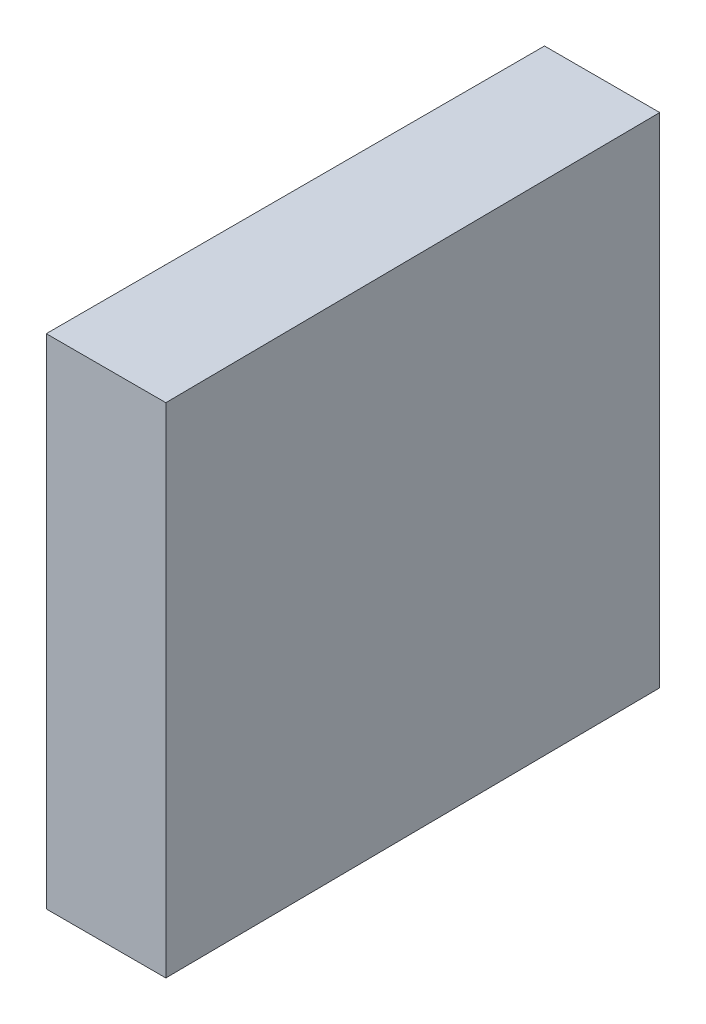
ISO-10303-21;
HEADER;
FILE_DESCRIPTION(('STEP AP214'),'2;1');
FILE_NAME('part.step','',(''),(''),'','','');
FILE_SCHEMA(('AUTOMOTIVE_DESIGN { 1 0 10303 214 1 1 1 1 }'));
ENDSEC;
DATA;
#1=APPLICATION_CONTEXT('core data for automotive mechanical design processes');
#2=APPLICATION_PROTOCOL_DEFINITION('international standard','automotive_design',2000,#1);
#3=PRODUCT_CONTEXT('',#1,'mechanical');
#4=PRODUCT('Part','Part','',(#3));
#5=PRODUCT_RELATED_PRODUCT_CATEGORY('part','',(#4));
#6=PRODUCT_DEFINITION_FORMATION('','',#4);
#7=PRODUCT_DEFINITION_CONTEXT('part definition',#1,'design');
#8=PRODUCT_DEFINITION('design','',#6,#7);
#9=PRODUCT_DEFINITION_SHAPE('','',#8);
#10=(LENGTH_UNIT() NAMED_UNIT(*) SI_UNIT(.MILLI.,.METRE.));
#11=(NAMED_UNIT(*) PLANE_ANGLE_UNIT() SI_UNIT($,.RADIAN.));
#12=(NAMED_UNIT(*) SI_UNIT($,.STERADIAN.) SOLID_ANGLE_UNIT());
#13=UNCERTAINTY_MEASURE_WITH_UNIT(LENGTH_MEASURE(1.E-05),#10,'distance_accuracy_value','');
#14=(GEOMETRIC_REPRESENTATION_CONTEXT(3) GLOBAL_UNCERTAINTY_ASSIGNED_CONTEXT((#13)) GLOBAL_UNIT_ASSIGNED_CONTEXT((#10,
#11,#12)) REPRESENTATION_CONTEXT('',''));
#15=CARTESIAN_POINT('',(0.,0.,0.));
#16=DIRECTION('',(0.,0.,1.));
#17=DIRECTION('',(1.,0.,0.));
#18=AXIS2_PLACEMENT_3D('',#15,#16,#17);
#19=CARTESIAN_POINT('',(0.,12.5,-6.25));
#20=DIRECTION('',(0.,0.,1.));
#21=DIRECTION('',(1.,0.,0.));
#22=AXIS2_PLACEMENT_3D('',#19,#20,#21);
#23=PLANE('',#22);
#24=DIRECTION('',(-1.,0.,0.));
#25=VECTOR('',#24,1.);
#26=CARTESIAN_POINT('',(0.,0.,-6.25));
#27=LINE('',#26,#25);
#28=CARTESIAN_POINT('',(2.8909141526156,0.,-6.25));
#29=VERTEX_POINT('',#28);
#30=CARTESIAN_POINT('',(0.,0.,-6.25));
#31=VERTEX_POINT('',#30);
#32=EDGE_CURVE('E96',#29,#31,#27,.T.);
#33=ORIENTED_EDGE('',*,*,#32,.T.);
#34=DIRECTION('',(0.,-1.,0.));
#35=VECTOR('',#34,1.);
#36=CARTESIAN_POINT('',(0.,12.5,-6.25));
#37=LINE('',#36,#35);
#38=CARTESIAN_POINT('',(0.,12.5,-6.25));
#39=VERTEX_POINT('',#38);
#40=EDGE_CURVE('E11',#39,#31,#37,.T.);
#41=ORIENTED_EDGE('',*,*,#40,.F.);
#42=DIRECTION('',(-1.,0.,0.));
#43=VECTOR('',#42,1.);
#44=CARTESIAN_POINT('',(0.,12.5,-6.25));
#45=LINE('',#44,#43);
#46=CARTESIAN_POINT('',(2.8909141526156,12.5,-6.25));
#47=VERTEX_POINT('',#46);
#48=EDGE_CURVE('E84',#47,#39,#45,.T.);
#49=ORIENTED_EDGE('',*,*,#48,.F.);
#50=DIRECTION('',(0.,-1.,0.));
#51=VECTOR('',#50,1.);
#52=CARTESIAN_POINT('',(2.8909141526156,12.5,-6.25));
#53=LINE('',#52,#51);
#54=EDGE_CURVE('E92',#47,#29,#53,.T.);
#55=ORIENTED_EDGE('',*,*,#54,.T.);
#56=EDGE_LOOP('',(#33,#41,#49,#55));
#57=FACE_BOUND('',#56,.T.);
#58=ADVANCED_FACE('F33',(#57),#23,.F.);
#59=CARTESIAN_POINT('',(0.,12.5,-6.25));
#60=DIRECTION('',(1.,0.,0.));
#61=DIRECTION('',(0.,0.,-1.));
#62=AXIS2_PLACEMENT_3D('',#59,#60,#61);
#63=PLANE('',#62);
#64=DIRECTION('',(0.,0.,1.));
#65=VECTOR('',#64,1.);
#66=CARTESIAN_POINT('',(0.,0.,-6.25));
#67=LINE('',#66,#65);
#68=CARTESIAN_POINT('',(0.,0.,6.25));
#69=VERTEX_POINT('',#68);
#70=EDGE_CURVE('E88',#31,#69,#67,.T.);
#71=ORIENTED_EDGE('',*,*,#70,.T.);
#72=DIRECTION('',(0.,-1.,0.));
#73=VECTOR('',#72,1.);
#74=CARTESIAN_POINT('',(0.,12.5,6.25));
#75=LINE('',#74,#73);
#76=CARTESIAN_POINT('',(0.,12.5,6.25));
#77=VERTEX_POINT('',#76);
#78=EDGE_CURVE('E41',#77,#69,#75,.T.);
#79=ORIENTED_EDGE('',*,*,#78,.F.);
#80=DIRECTION('',(0.,0.,1.));
#81=VECTOR('',#80,1.);
#82=CARTESIAN_POINT('',(0.,12.5,-6.25));
#83=LINE('',#82,#81);
#84=EDGE_CURVE('E79',#39,#77,#83,.T.);
#85=ORIENTED_EDGE('',*,*,#84,.F.);
#86=ORIENTED_EDGE('',*,*,#40,.T.);
#87=EDGE_LOOP('',(#71,#79,#85,#86));
#88=FACE_BOUND('',#87,.T.);
#89=ADVANCED_FACE('F87',(#88),#63,.F.);
#90=CARTESIAN_POINT('',(0.,12.5,6.25));
#91=DIRECTION('',(0.,0.,-1.));
#92=DIRECTION('',(-1.,0.,0.));
#93=AXIS2_PLACEMENT_3D('',#90,#91,#92);
#94=PLANE('',#93);
#95=DIRECTION('',(1.,0.,0.));
#96=VECTOR('',#95,1.);
#97=CARTESIAN_POINT('',(0.,0.,6.25));
#98=LINE('',#97,#96);
#99=CARTESIAN_POINT('',(3.,0.,6.25));
#100=VERTEX_POINT('',#99);
#101=EDGE_CURVE('E66',#69,#100,#98,.T.);
#102=ORIENTED_EDGE('',*,*,#101,.T.);
#103=DIRECTION('',(0.,-1.,0.));
#104=VECTOR('',#103,1.);
#105=CARTESIAN_POINT('',(3.,12.5,6.25));
#106=LINE('',#105,#104);
#107=CARTESIAN_POINT('',(3.,12.5,6.25));
#108=VERTEX_POINT('',#107);
#109=EDGE_CURVE('E89',#108,#100,#106,.T.);
#110=ORIENTED_EDGE('',*,*,#109,.F.);
#111=DIRECTION('',(1.,0.,0.));
#112=VECTOR('',#111,1.);
#113=CARTESIAN_POINT('',(0.,12.5,6.25));
#114=LINE('',#113,#112);
#115=EDGE_CURVE('E82',#77,#108,#114,.T.);
#116=ORIENTED_EDGE('',*,*,#115,.F.);
#117=ORIENTED_EDGE('',*,*,#78,.T.);
#118=EDGE_LOOP('',(#102,#110,#116,#117));
#119=FACE_BOUND('',#118,.T.);
#120=ADVANCED_FACE('F90',(#119),#94,.F.);
#121=CARTESIAN_POINT('',(3.,12.5,6.25));
#122=DIRECTION('',(-0.999961923064171,0.,0.00872653549836698));
#123=DIRECTION('',(0.00872653549836698,0.,0.999961923064171));
#124=AXIS2_PLACEMENT_3D('',#121,#122,#123);
#125=PLANE('',#124);
#126=DIRECTION('',(-0.00872653549836698,0.,-0.999961923064171));
#127=VECTOR('',#126,1.);
#128=CARTESIAN_POINT('',(3.,0.,6.25));
#129=LINE('',#128,#127);
#130=EDGE_CURVE('E72',#100,#29,#129,.T.);
#131=ORIENTED_EDGE('',*,*,#130,.T.);
#132=ORIENTED_EDGE('',*,*,#54,.F.);
#133=DIRECTION('',(-0.00872653549836698,0.,-0.999961923064171));
#134=VECTOR('',#133,1.);
#135=CARTESIAN_POINT('',(3.,12.5,6.25));
#136=LINE('',#135,#134);
#137=EDGE_CURVE('E49',#108,#47,#136,.T.);
#138=ORIENTED_EDGE('',*,*,#137,.F.);
#139=ORIENTED_EDGE('',*,*,#109,.T.);
#140=EDGE_LOOP('',(#131,#132,#138,#139));
#141=FACE_BOUND('',#140,.T.);
#142=ADVANCED_FACE('F103',(#141),#125,.F.);
#143=CARTESIAN_POINT('',(0.,12.5,0.));
#144=DIRECTION('',(0.,-1.,0.));
#145=DIRECTION('',(0.,0.,-1.));
#146=AXIS2_PLACEMENT_3D('',#143,#144,#145);
#147=PLANE('',#146);
#148=ORIENTED_EDGE('',*,*,#48,.T.);
#149=ORIENTED_EDGE('',*,*,#84,.T.);
#150=ORIENTED_EDGE('',*,*,#115,.T.);
#151=ORIENTED_EDGE('',*,*,#137,.T.);
#152=EDGE_LOOP('',(#148,#149,#150,#151));
#153=FACE_BOUND('',#152,.T.);
#154=ADVANCED_FACE('F80',(#153),#147,.F.);
#155=CARTESIAN_POINT('',(0.,0.,0.));
#156=DIRECTION('',(0.,-1.,0.));
#157=DIRECTION('',(0.,0.,-1.));
#158=AXIS2_PLACEMENT_3D('',#155,#156,#157);
#159=PLANE('',#158);
#160=ORIENTED_EDGE('',*,*,#32,.F.);
#161=ORIENTED_EDGE('',*,*,#130,.F.);
#162=ORIENTED_EDGE('',*,*,#101,.F.);
#163=ORIENTED_EDGE('',*,*,#70,.F.);
#164=EDGE_LOOP('',(#160,#161,#162,#163));
#165=FACE_BOUND('',#164,.T.);
#166=ADVANCED_FACE('F106',(#165),#159,.T.);
#167=CLOSED_SHELL('',(#58,#89,#120,#142,#154,#166));
#168=MANIFOLD_SOLID_BREP('B2',#167);
#169=ADVANCED_BREP_SHAPE_REPRESENTATION('',(#18,#168),#14);
#170=SHAPE_DEFINITION_REPRESENTATION(#9,#169);
ENDSEC;
END-ISO-10303-21;
